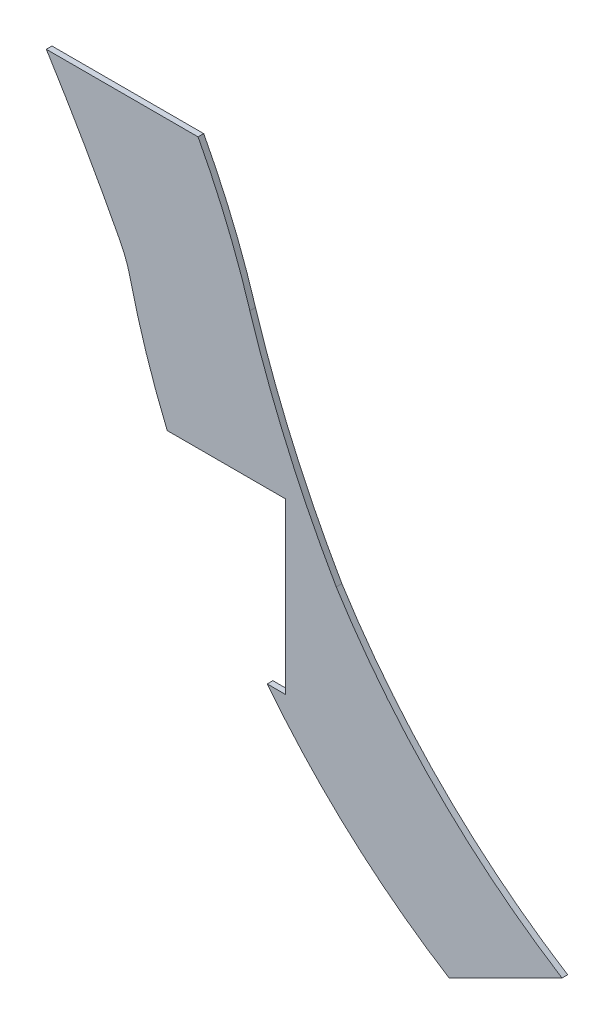
ISO-10303-21;
HEADER;
FILE_DESCRIPTION(('STEP AP214'),'2;1');
FILE_NAME('part.step','',(''),(''),'','','');
FILE_SCHEMA(('AUTOMOTIVE_DESIGN { 1 0 10303 214 1 1 1 1 }'));
ENDSEC;
DATA;
#1=APPLICATION_CONTEXT('core data for automotive mechanical design processes');
#2=APPLICATION_PROTOCOL_DEFINITION('international standard','automotive_design',2000,#1);
#3=PRODUCT_CONTEXT('',#1,'mechanical');
#4=PRODUCT('Part','Part','',(#3));
#5=PRODUCT_RELATED_PRODUCT_CATEGORY('part','',(#4));
#6=PRODUCT_DEFINITION_FORMATION('','',#4);
#7=PRODUCT_DEFINITION_CONTEXT('part definition',#1,'design');
#8=PRODUCT_DEFINITION('design','',#6,#7);
#9=PRODUCT_DEFINITION_SHAPE('','',#8);
#10=(LENGTH_UNIT() NAMED_UNIT(*) SI_UNIT(.MILLI.,.METRE.));
#11=(NAMED_UNIT(*) PLANE_ANGLE_UNIT() SI_UNIT($,.RADIAN.));
#12=(NAMED_UNIT(*) SI_UNIT($,.STERADIAN.) SOLID_ANGLE_UNIT());
#13=UNCERTAINTY_MEASURE_WITH_UNIT(LENGTH_MEASURE(1.E-05),#10,'distance_accuracy_value','');
#14=(GEOMETRIC_REPRESENTATION_CONTEXT(3) GLOBAL_UNCERTAINTY_ASSIGNED_CONTEXT((#13)) GLOBAL_UNIT_ASSIGNED_CONTEXT((#10,
#11,#12)) REPRESENTATION_CONTEXT('',''));
#15=CARTESIAN_POINT('',(0.,0.,0.));
#16=DIRECTION('',(0.,0.,1.));
#17=DIRECTION('',(1.,0.,0.));
#18=AXIS2_PLACEMENT_3D('',#15,#16,#17);
#19=CARTESIAN_POINT('',(25.0531359771386,18.4216146752966,0.1));
#20=DIRECTION('',(0.,0.,-1.));
#21=DIRECTION('',(-1.,0.,0.));
#22=AXIS2_PLACEMENT_3D('',#19,#20,#21);
#23=CYLINDRICAL_SURFACE('',#22,2.00000000000005);
#24=CARTESIAN_POINT('',(25.0531359771386,18.4216146752966,0.));
#25=DIRECTION('',(0.,0.,-1.));
#26=DIRECTION('',(1.,0.,0.));
#27=AXIS2_PLACEMENT_3D('',#24,#25,#26);
#28=CIRCLE('',#27,2.00000000000005);
#29=CARTESIAN_POINT('',(26.826595188816,19.346191564753,0.));
#30=VERTEX_POINT('',#29);
#31=CARTESIAN_POINT('',(26.9993397412909,18.8823650506623,0.));
#32=VERTEX_POINT('',#31);
#33=EDGE_CURVE('E153',#30,#32,#28,.T.);
#34=ORIENTED_EDGE('',*,*,#33,.T.);
#35=DIRECTION('',(0.,0.,-1.));
#36=VECTOR('',#35,1.);
#37=CARTESIAN_POINT('',(26.9993397412909,18.8823650506623,0.1));
#38=LINE('',#37,#36);
#39=CARTESIAN_POINT('',(26.9993397412909,18.8823650506623,0.1));
#40=VERTEX_POINT('',#39);
#41=EDGE_CURVE('E11',#40,#32,#38,.T.);
#42=ORIENTED_EDGE('',*,*,#41,.F.);
#43=CARTESIAN_POINT('',(25.0531359771386,18.4216146752966,0.1));
#44=DIRECTION('',(0.,0.,-1.));
#45=DIRECTION('',(1.,0.,0.));
#46=AXIS2_PLACEMENT_3D('',#43,#44,#45);
#47=CIRCLE('',#46,2.00000000000005);
#48=CARTESIAN_POINT('',(26.826595188816,19.346191564753,0.1));
#49=VERTEX_POINT('',#48);
#50=EDGE_CURVE('E175',#49,#40,#47,.T.);
#51=ORIENTED_EDGE('',*,*,#50,.F.);
#52=DIRECTION('',(0.,0.,-1.));
#53=VECTOR('',#52,1.);
#54=CARTESIAN_POINT('',(26.826595188816,19.346191564753,0.1));
#55=LINE('',#54,#53);
#56=EDGE_CURVE('E149',#49,#30,#55,.T.);
#57=ORIENTED_EDGE('',*,*,#56,.T.);
#58=EDGE_LOOP('',(#34,#42,#51,#57));
#59=FACE_BOUND('',#58,.T.);
#60=ADVANCED_FACE('F33',(#59),#23,.F.);
#61=CARTESIAN_POINT('',(39.5395657064379,21.8511774263431,0.1));
#62=DIRECTION('',(0.,0.,-1.));
#63=DIRECTION('',(-1.,0.,0.));
#64=AXIS2_PLACEMENT_3D('',#61,#62,#63);
#65=CYLINDRICAL_SURFACE('',#64,12.886858196587);
#66=CARTESIAN_POINT('',(39.5395657064379,21.8511774263431,0.));
#67=DIRECTION('',(0.,0.,1.));
#68=DIRECTION('',(1.,0.,0.));
#69=AXIS2_PLACEMENT_3D('',#66,#67,#68);
#70=CIRCLE('',#69,12.886858196587);
#71=CARTESIAN_POINT('',(27.6581064660367,16.8609829914912,0.));
#72=VERTEX_POINT('',#71);
#73=EDGE_CURVE('E156',#32,#72,#70,.T.);
#74=ORIENTED_EDGE('',*,*,#73,.T.);
#75=DIRECTION('',(0.,0.,-1.));
#76=VECTOR('',#75,1.);
#77=CARTESIAN_POINT('',(27.6581064660367,16.8609829914912,0.1));
#78=LINE('',#77,#76);
#79=CARTESIAN_POINT('',(27.6581064660367,16.8609829914912,0.1));
#80=VERTEX_POINT('',#79);
#81=EDGE_CURVE('E41',#80,#72,#78,.T.);
#82=ORIENTED_EDGE('',*,*,#81,.F.);
#83=CARTESIAN_POINT('',(39.5395657064379,21.8511774263431,0.1));
#84=DIRECTION('',(0.,0.,1.));
#85=DIRECTION('',(1.,0.,0.));
#86=AXIS2_PLACEMENT_3D('',#83,#84,#85);
#87=CIRCLE('',#86,12.886858196587);
#88=EDGE_CURVE('E104',#40,#80,#87,.T.);
#89=ORIENTED_EDGE('',*,*,#88,.F.);
#90=ORIENTED_EDGE('',*,*,#41,.T.);
#91=EDGE_LOOP('',(#74,#82,#89,#90));
#92=FACE_BOUND('',#91,.T.);
#93=ADVANCED_FACE('F253',(#92),#65,.T.);
#94=CARTESIAN_POINT('',(27.6581064660367,16.8609829914912,0.1));
#95=DIRECTION('',(0.,1.,0.));
#96=DIRECTION('',(0.,0.,1.));
#97=AXIS2_PLACEMENT_3D('',#94,#95,#96);
#98=PLANE('',#97);
#99=DIRECTION('',(1.,0.,0.));
#100=VECTOR('',#99,1.);
#101=CARTESIAN_POINT('',(27.6581064660367,16.8609829914912,0.));
#102=LINE('',#101,#100);
#103=CARTESIAN_POINT('',(29.7506287284139,16.8609829914912,0.));
#104=VERTEX_POINT('',#103);
#105=EDGE_CURVE('E158',#72,#104,#102,.T.);
#106=ORIENTED_EDGE('',*,*,#105,.T.);
#107=DIRECTION('',(0.,0.,-1.));
#108=VECTOR('',#107,1.);
#109=CARTESIAN_POINT('',(29.7506287284139,16.8609829914912,0.1));
#110=LINE('',#109,#108);
#111=CARTESIAN_POINT('',(29.7506287284139,16.8609829914912,0.1));
#112=VERTEX_POINT('',#111);
#113=EDGE_CURVE('E194',#112,#104,#110,.T.);
#114=ORIENTED_EDGE('',*,*,#113,.F.);
#115=DIRECTION('',(1.,0.,0.));
#116=VECTOR('',#115,1.);
#117=CARTESIAN_POINT('',(27.6581064660367,16.8609829914912,0.1));
#118=LINE('',#117,#116);
#119=EDGE_CURVE('E202',#80,#112,#118,.T.);
#120=ORIENTED_EDGE('',*,*,#119,.F.);
#121=ORIENTED_EDGE('',*,*,#81,.T.);
#122=EDGE_LOOP('',(#106,#114,#120,#121));
#123=FACE_BOUND('',#122,.T.);
#124=ADVANCED_FACE('F200',(#123),#98,.F.);
#125=CARTESIAN_POINT('',(29.7506287284139,16.8609829914912,0.1));
#126=DIRECTION('',(1.,0.,0.));
#127=DIRECTION('',(0.,0.,-1.));
#128=AXIS2_PLACEMENT_3D('',#125,#126,#127);
#129=PLANE('',#128);
#130=DIRECTION('',(0.,-1.,0.));
#131=VECTOR('',#130,1.);
#132=CARTESIAN_POINT('',(29.7506287284139,16.8609829914912,0.));
#133=LINE('',#132,#131);
#134=CARTESIAN_POINT('',(29.7506287284139,13.8609829914912,0.));
#135=VERTEX_POINT('',#134);
#136=EDGE_CURVE('E160',#104,#135,#133,.T.);
#137=ORIENTED_EDGE('',*,*,#136,.T.);
#138=DIRECTION('',(0.,0.,-1.));
#139=VECTOR('',#138,1.);
#140=CARTESIAN_POINT('',(29.7506287284139,13.8609829914912,0.1));
#141=LINE('',#140,#139);
#142=CARTESIAN_POINT('',(29.7506287284139,13.8609829914912,0.1));
#143=VERTEX_POINT('',#142);
#144=EDGE_CURVE('E191',#143,#135,#141,.T.);
#145=ORIENTED_EDGE('',*,*,#144,.F.);
#146=DIRECTION('',(0.,-1.,0.));
#147=VECTOR('',#146,1.);
#148=CARTESIAN_POINT('',(29.7506287284139,16.8609829914912,0.1));
#149=LINE('',#148,#147);
#150=EDGE_CURVE('E220',#112,#143,#149,.T.);
#151=ORIENTED_EDGE('',*,*,#150,.F.);
#152=ORIENTED_EDGE('',*,*,#113,.T.);
#153=EDGE_LOOP('',(#137,#145,#151,#152));
#154=FACE_BOUND('',#153,.T.);
#155=ADVANCED_FACE('F211',(#154),#129,.F.);
#156=CARTESIAN_POINT('',(29.7506287284139,13.8609829914912,0.1));
#157=DIRECTION('',(0.,-1.,0.));
#158=DIRECTION('',(0.,0.,-1.));
#159=AXIS2_PLACEMENT_3D('',#156,#157,#158);
#160=PLANE('',#159);
#161=DIRECTION('',(-1.,0.,0.));
#162=VECTOR('',#161,1.);
#163=CARTESIAN_POINT('',(29.7506287284139,13.8609829914912,0.));
#164=LINE('',#163,#162);
#165=CARTESIAN_POINT('',(29.4287839823474,13.8609829914912,0.));
#166=VERTEX_POINT('',#165);
#167=EDGE_CURVE('E162',#135,#166,#164,.T.);
#168=ORIENTED_EDGE('',*,*,#167,.T.);
#169=DIRECTION('',(0.,0.,-1.));
#170=VECTOR('',#169,1.);
#171=CARTESIAN_POINT('',(29.4287839823474,13.8609829914912,0.1));
#172=LINE('',#171,#170);
#173=CARTESIAN_POINT('',(29.4287839823474,13.8609829914912,0.1));
#174=VERTEX_POINT('',#173);
#175=EDGE_CURVE('E188',#174,#166,#172,.T.);
#176=ORIENTED_EDGE('',*,*,#175,.F.);
#177=DIRECTION('',(-1.,0.,0.));
#178=VECTOR('',#177,1.);
#179=CARTESIAN_POINT('',(29.7506287284139,13.8609829914912,0.1));
#180=LINE('',#179,#178);
#181=EDGE_CURVE('E217',#143,#174,#180,.T.);
#182=ORIENTED_EDGE('',*,*,#181,.F.);
#183=ORIENTED_EDGE('',*,*,#144,.T.);
#184=EDGE_LOOP('',(#168,#176,#182,#183));
#185=FACE_BOUND('',#184,.T.);
#186=ADVANCED_FACE('F215',(#185),#160,.F.);
#187=CARTESIAN_POINT('',(39.2940269394782,21.5784950015548,0.1));
#188=DIRECTION('',(0.,0.,-1.));
#189=DIRECTION('',(-1.,0.,0.));
#190=AXIS2_PLACEMENT_3D('',#187,#188,#189);
#191=CYLINDRICAL_SURFACE('',#190,12.5252948160391);
#192=CARTESIAN_POINT('',(39.2940269394782,21.5784950015548,0.));
#193=DIRECTION('',(0.,0.,1.));
#194=DIRECTION('',(1.,0.,0.));
#195=AXIS2_PLACEMENT_3D('',#192,#193,#194);
#196=CIRCLE('',#195,12.5252948160391);
#197=CARTESIAN_POINT('',(32.6493712715861,10.9609829914912,0.));
#198=VERTEX_POINT('',#197);
#199=EDGE_CURVE('E164',#166,#198,#196,.T.);
#200=ORIENTED_EDGE('',*,*,#199,.T.);
#201=DIRECTION('',(0.,0.,-1.));
#202=VECTOR('',#201,1.);
#203=CARTESIAN_POINT('',(32.6493712715861,10.9609829914912,0.1));
#204=LINE('',#203,#202);
#205=CARTESIAN_POINT('',(32.6493712715861,10.9609829914912,0.1));
#206=VERTEX_POINT('',#205);
#207=EDGE_CURVE('E185',#206,#198,#204,.T.);
#208=ORIENTED_EDGE('',*,*,#207,.F.);
#209=CARTESIAN_POINT('',(39.2940269394782,21.5784950015548,0.1));
#210=DIRECTION('',(0.,0.,1.));
#211=DIRECTION('',(1.,0.,0.));
#212=AXIS2_PLACEMENT_3D('',#209,#210,#211);
#213=CIRCLE('',#212,12.5252948160391);
#214=EDGE_CURVE('E219',#174,#206,#213,.T.);
#215=ORIENTED_EDGE('',*,*,#214,.F.);
#216=ORIENTED_EDGE('',*,*,#175,.T.);
#217=EDGE_LOOP('',(#200,#208,#215,#216));
#218=FACE_BOUND('',#217,.T.);
#219=ADVANCED_FACE('F266',(#218),#191,.T.);
#220=CARTESIAN_POINT('',(34.6493712715861,11.9609829914912,0.1));
#221=DIRECTION('',(-0.447213595499959,0.894427190999916,0.));
#222=DIRECTION('',(-0.894427190999916,-0.447213595499959,0.));
#223=AXIS2_PLACEMENT_3D('',#220,#221,#222);
#224=PLANE('',#223);
#225=DIRECTION('',(0.894427190999916,0.447213595499959,0.));
#226=VECTOR('',#225,1.);
#227=CARTESIAN_POINT('',(34.6493712715861,11.9609829914912,0.));
#228=LINE('',#227,#226);
#229=CARTESIAN_POINT('',(34.6493712715861,11.9609829914912,0.));
#230=VERTEX_POINT('',#229);
#231=EDGE_CURVE('E166',#198,#230,#228,.T.);
#232=ORIENTED_EDGE('',*,*,#231,.T.);
#233=DIRECTION('',(0.,0.,-1.));
#234=VECTOR('',#233,1.);
#235=CARTESIAN_POINT('',(34.6493712715861,11.9609829914912,0.1));
#236=LINE('',#235,#234);
#237=CARTESIAN_POINT('',(34.6493712715861,11.9609829914912,0.1));
#238=VERTEX_POINT('',#237);
#239=EDGE_CURVE('E182',#238,#230,#236,.T.);
#240=ORIENTED_EDGE('',*,*,#239,.F.);
#241=DIRECTION('',(0.894427190999916,0.447213595499959,0.));
#242=VECTOR('',#241,1.);
#243=CARTESIAN_POINT('',(34.6493712715861,11.9609829914912,0.1));
#244=LINE('',#243,#242);
#245=EDGE_CURVE('E222',#206,#238,#244,.T.);
#246=ORIENTED_EDGE('',*,*,#245,.F.);
#247=ORIENTED_EDGE('',*,*,#207,.T.);
#248=EDGE_LOOP('',(#232,#240,#246,#247));
#249=FACE_BOUND('',#248,.T.);
#250=ADVANCED_FACE('F269',(#249),#224,.F.);
#251=CARTESIAN_POINT('',(41.4999082882115,22.8115200081166,0.1));
#252=DIRECTION('',(0.,0.,-1.));
#253=DIRECTION('',(-1.,0.,0.));
#254=AXIS2_PLACEMENT_3D('',#251,#252,#253);
#255=CYLINDRICAL_SURFACE('',#254,12.8321475585856);
#256=CARTESIAN_POINT('',(41.4999082882115,22.8115200081166,0.));
#257=DIRECTION('',(0.,0.,-1.));
#258=DIRECTION('',(1.,0.,0.));
#259=AXIS2_PLACEMENT_3D('',#256,#257,#258);
#260=CIRCLE('',#259,12.8321475585856);
#261=CARTESIAN_POINT('',(30.6506287284139,15.9589917156779,0.));
#262=VERTEX_POINT('',#261);
#263=EDGE_CURVE('E168',#230,#262,#260,.T.);
#264=ORIENTED_EDGE('',*,*,#263,.T.);
#265=DIRECTION('',(0.,0.,-1.));
#266=VECTOR('',#265,1.);
#267=CARTESIAN_POINT('',(30.6506287284139,15.9589917156779,0.1));
#268=LINE('',#267,#266);
#269=CARTESIAN_POINT('',(30.6506287284139,15.9589917156779,0.1));
#270=VERTEX_POINT('',#269);
#271=EDGE_CURVE('E179',#270,#262,#268,.T.);
#272=ORIENTED_EDGE('',*,*,#271,.F.);
#273=CARTESIAN_POINT('',(41.4999082882115,22.8115200081166,0.1));
#274=DIRECTION('',(0.,0.,-1.));
#275=DIRECTION('',(1.,0.,0.));
#276=AXIS2_PLACEMENT_3D('',#273,#274,#275);
#277=CIRCLE('',#276,12.8321475585856);
#278=EDGE_CURVE('E228',#238,#270,#277,.T.);
#279=ORIENTED_EDGE('',*,*,#278,.F.);
#280=ORIENTED_EDGE('',*,*,#239,.T.);
#281=EDGE_LOOP('',(#264,#272,#279,#280));
#282=FACE_BOUND('',#281,.T.);
#283=ADVANCED_FACE('F234',(#282),#255,.F.);
#284=CARTESIAN_POINT('',(45.9274365244144,24.7620854048661,0.1));
#285=DIRECTION('',(0.,0.,-1.));
#286=DIRECTION('',(-1.,0.,0.));
#287=AXIS2_PLACEMENT_3D('',#284,#285,#286);
#288=CYLINDRICAL_SURFACE('',#287,17.6316566135053);
#289=CARTESIAN_POINT('',(45.9274365244144,24.7620854048661,0.));
#290=DIRECTION('',(0.,0.,-1.));
#291=DIRECTION('',(1.,0.,0.));
#292=AXIS2_PLACEMENT_3D('',#289,#290,#291);
#293=CIRCLE('',#292,17.6316566135053);
#294=CARTESIAN_POINT('',(29.1211004272167,19.4308208339979,0.));
#295=VERTEX_POINT('',#294);
#296=EDGE_CURVE('E170',#262,#295,#293,.T.);
#297=ORIENTED_EDGE('',*,*,#296,.T.);
#298=DIRECTION('',(0.,0.,-1.));
#299=VECTOR('',#298,1.);
#300=CARTESIAN_POINT('',(29.1211004272167,19.4308208339979,0.1));
#301=LINE('',#300,#299);
#302=CARTESIAN_POINT('',(29.1211004272167,19.4308208339979,0.1));
#303=VERTEX_POINT('',#302);
#304=EDGE_CURVE('E144',#303,#295,#301,.T.);
#305=ORIENTED_EDGE('',*,*,#304,.F.);
#306=CARTESIAN_POINT('',(45.9274365244144,24.7620854048661,0.1));
#307=DIRECTION('',(0.,0.,-1.));
#308=DIRECTION('',(1.,0.,0.));
#309=AXIS2_PLACEMENT_3D('',#306,#307,#308);
#310=CIRCLE('',#309,17.6316566135053);
#311=EDGE_CURVE('E135',#270,#303,#310,.T.);
#312=ORIENTED_EDGE('',*,*,#311,.F.);
#313=ORIENTED_EDGE('',*,*,#271,.T.);
#314=EDGE_LOOP('',(#297,#305,#312,#313));
#315=FACE_BOUND('',#314,.T.);
#316=ADVANCED_FACE('F238',(#315),#288,.F.);
#317=CARTESIAN_POINT('',(17.0688324988075,15.7194628367271,0.1));
#318=DIRECTION('',(0.,0.,-1.));
#319=DIRECTION('',(-1.,0.,0.));
#320=AXIS2_PLACEMENT_3D('',#317,#318,#319);
#321=CYLINDRICAL_SURFACE('',#320,12.6107628794639);
#322=CARTESIAN_POINT('',(17.0688324988075,15.7194628367271,0.));
#323=DIRECTION('',(0.,0.,1.));
#324=DIRECTION('',(1.,0.,0.));
#325=AXIS2_PLACEMENT_3D('',#322,#323,#324);
#326=CIRCLE('',#325,12.6107628794639);
#327=CARTESIAN_POINT('',(28.2039220273837,21.6390170085088,0.));
#328=VERTEX_POINT('',#327);
#329=EDGE_CURVE('E143',#295,#328,#326,.T.);
#330=ORIENTED_EDGE('',*,*,#329,.T.);
#331=DIRECTION('',(0.,0.,-1.));
#332=VECTOR('',#331,1.);
#333=CARTESIAN_POINT('',(28.2039220273837,21.6390170085088,0.1));
#334=LINE('',#333,#332);
#335=CARTESIAN_POINT('',(28.2039220273837,21.6390170085088,0.1));
#336=VERTEX_POINT('',#335);
#337=EDGE_CURVE('E140',#336,#328,#334,.T.);
#338=ORIENTED_EDGE('',*,*,#337,.F.);
#339=CARTESIAN_POINT('',(17.0688324988075,15.7194628367271,0.1));
#340=DIRECTION('',(0.,0.,1.));
#341=DIRECTION('',(1.,0.,0.));
#342=AXIS2_PLACEMENT_3D('',#339,#340,#341);
#343=CIRCLE('',#342,12.6107628794639);
#344=EDGE_CURVE('E129',#303,#336,#343,.T.);
#345=ORIENTED_EDGE('',*,*,#344,.F.);
#346=ORIENTED_EDGE('',*,*,#304,.T.);
#347=EDGE_LOOP('',(#330,#338,#345,#346));
#348=FACE_BOUND('',#347,.T.);
#349=ADVANCED_FACE('F141',(#348),#321,.T.);
#350=CARTESIAN_POINT('',(25.5166391332646,21.6390170085088,0.1));
#351=DIRECTION('',(0.,-1.,0.));
#352=DIRECTION('',(1.,0.,0.));
#353=AXIS2_PLACEMENT_3D('',#350,#351,#352);
#354=PLANE('',#353);
#355=DIRECTION('',(-1.,0.,0.));
#356=VECTOR('',#355,1.);
#357=CARTESIAN_POINT('',(25.5166391332646,21.6390170085088,0.));
#358=LINE('',#357,#356);
#359=CARTESIAN_POINT('',(25.5166391332646,21.6390170085088,0.));
#360=VERTEX_POINT('',#359);
#361=EDGE_CURVE('E90',#328,#360,#358,.T.);
#362=ORIENTED_EDGE('',*,*,#361,.T.);
#363=DIRECTION('',(0.,0.,-1.));
#364=VECTOR('',#363,1.);
#365=CARTESIAN_POINT('',(25.5166391332646,21.6390170085088,0.1));
#366=LINE('',#365,#364);
#367=CARTESIAN_POINT('',(25.5166391332646,21.6390170085088,0.1));
#368=VERTEX_POINT('',#367);
#369=EDGE_CURVE('E145',#368,#360,#366,.T.);
#370=ORIENTED_EDGE('',*,*,#369,.F.);
#371=DIRECTION('',(-1.,0.,0.));
#372=VECTOR('',#371,1.);
#373=CARTESIAN_POINT('',(25.5166391332646,21.6390170085088,0.1));
#374=LINE('',#373,#372);
#375=EDGE_CURVE('E133',#336,#368,#374,.T.);
#376=ORIENTED_EDGE('',*,*,#375,.F.);
#377=ORIENTED_EDGE('',*,*,#337,.T.);
#378=EDGE_LOOP('',(#362,#370,#376,#377));
#379=FACE_BOUND('',#378,.T.);
#380=ADVANCED_FACE('F147',(#379),#354,.F.);
#381=CARTESIAN_POINT('',(-3.59350000689792,3.48695059218034,0.1));
#382=DIRECTION('',(0.,0.,-1.));
#383=DIRECTION('',(-1.,0.,0.));
#384=AXIS2_PLACEMENT_3D('',#381,#382,#383);
#385=CYLINDRICAL_SURFACE('',#384,34.3059428662502);
#386=CARTESIAN_POINT('',(-3.59350000689792,3.48695059218034,0.));
#387=DIRECTION('',(0.,0.,-1.));
#388=DIRECTION('',(1.,0.,0.));
#389=AXIS2_PLACEMENT_3D('',#386,#387,#388);
#390=CIRCLE('',#389,34.3059428662502);
#391=EDGE_CURVE('E96',#360,#30,#390,.T.);
#392=ORIENTED_EDGE('',*,*,#391,.T.);
#393=ORIENTED_EDGE('',*,*,#56,.F.);
#394=CARTESIAN_POINT('',(-3.59350000689792,3.48695059218034,0.1));
#395=DIRECTION('',(0.,0.,-1.));
#396=DIRECTION('',(1.,0.,0.));
#397=AXIS2_PLACEMENT_3D('',#394,#395,#396);
#398=CIRCLE('',#397,34.3059428662502);
#399=EDGE_CURVE('E49',#368,#49,#398,.T.);
#400=ORIENTED_EDGE('',*,*,#399,.F.);
#401=ORIENTED_EDGE('',*,*,#369,.T.);
#402=EDGE_LOOP('',(#392,#393,#400,#401));
#403=FACE_BOUND('',#402,.T.);
#404=ADVANCED_FACE('F242',(#403),#385,.F.);
#405=CARTESIAN_POINT('',(25.0531359771386,18.4216146752966,0.1));
#406=DIRECTION('',(0.,0.,1.));
#407=DIRECTION('',(1.,0.,0.));
#408=AXIS2_PLACEMENT_3D('',#405,#406,#407);
#409=PLANE('',#408);
#410=ORIENTED_EDGE('',*,*,#50,.T.);
#411=ORIENTED_EDGE('',*,*,#88,.T.);
#412=ORIENTED_EDGE('',*,*,#119,.T.);
#413=ORIENTED_EDGE('',*,*,#150,.T.);
#414=ORIENTED_EDGE('',*,*,#181,.T.);
#415=ORIENTED_EDGE('',*,*,#214,.T.);
#416=ORIENTED_EDGE('',*,*,#245,.T.);
#417=ORIENTED_EDGE('',*,*,#278,.T.);
#418=ORIENTED_EDGE('',*,*,#311,.T.);
#419=ORIENTED_EDGE('',*,*,#344,.T.);
#420=ORIENTED_EDGE('',*,*,#375,.T.);
#421=ORIENTED_EDGE('',*,*,#399,.T.);
#422=EDGE_LOOP('',(#410,#411,#412,#413,#414,#415,#416,#417,#418,#419,#420,#421));
#423=FACE_BOUND('',#422,.T.);
#424=ADVANCED_FACE('F131',(#423),#409,.T.);
#425=CARTESIAN_POINT('',(25.0531359771386,18.4216146752966,0.));
#426=DIRECTION('',(0.,0.,1.));
#427=DIRECTION('',(1.,0.,0.));
#428=AXIS2_PLACEMENT_3D('',#425,#426,#427);
#429=PLANE('',#428);
#430=ORIENTED_EDGE('',*,*,#33,.F.);
#431=ORIENTED_EDGE('',*,*,#391,.F.);
#432=ORIENTED_EDGE('',*,*,#361,.F.);
#433=ORIENTED_EDGE('',*,*,#329,.F.);
#434=ORIENTED_EDGE('',*,*,#296,.F.);
#435=ORIENTED_EDGE('',*,*,#263,.F.);
#436=ORIENTED_EDGE('',*,*,#231,.F.);
#437=ORIENTED_EDGE('',*,*,#199,.F.);
#438=ORIENTED_EDGE('',*,*,#167,.F.);
#439=ORIENTED_EDGE('',*,*,#136,.F.);
#440=ORIENTED_EDGE('',*,*,#105,.F.);
#441=ORIENTED_EDGE('',*,*,#73,.F.);
#442=EDGE_LOOP('',(#430,#431,#432,#433,#434,#435,#436,#437,#438,#439,#440,#441));
#443=FACE_BOUND('',#442,.T.);
#444=ADVANCED_FACE('F206',(#443),#429,.F.);
#445=CLOSED_SHELL('',(#60,#93,#124,#155,#186,#219,#250,#283,#316,#349,#380,#404,#424,#444));
#446=MANIFOLD_SOLID_BREP('B2',#445);
#447=ADVANCED_BREP_SHAPE_REPRESENTATION('',(#18,#446),#14);
#448=SHAPE_DEFINITION_REPRESENTATION(#9,#447);
ENDSEC;
END-ISO-10303-21;
